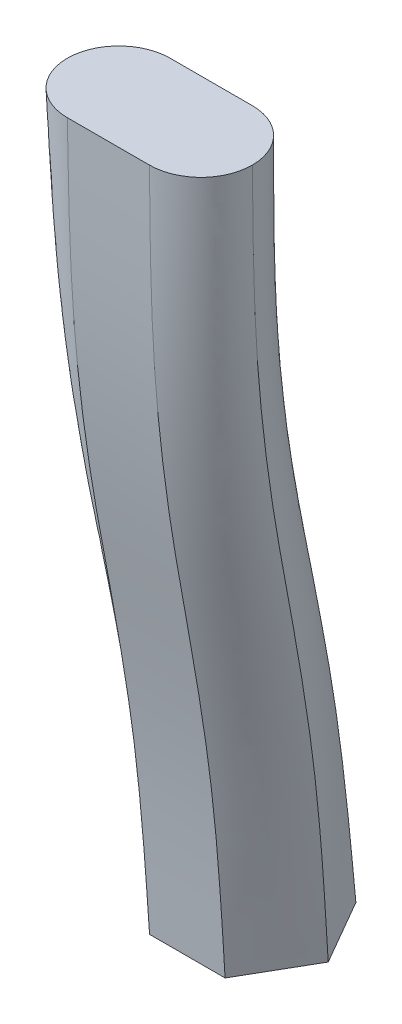
ISO-10303-21;
HEADER;
FILE_DESCRIPTION(('STEP AP214'),'2;1');
FILE_NAME('part.step','',(''),(''),'','','');
FILE_SCHEMA(('AUTOMOTIVE_DESIGN { 1 0 10303 214 1 1 1 1 }'));
ENDSEC;
DATA;
#1=APPLICATION_CONTEXT('core data for automotive mechanical design processes');
#2=APPLICATION_PROTOCOL_DEFINITION('international standard','automotive_design',2000,#1);
#3=PRODUCT_CONTEXT('',#1,'mechanical');
#4=PRODUCT('Part','Part','',(#3));
#5=PRODUCT_RELATED_PRODUCT_CATEGORY('part','',(#4));
#6=PRODUCT_DEFINITION_FORMATION('','',#4);
#7=PRODUCT_DEFINITION_CONTEXT('part definition',#1,'design');
#8=PRODUCT_DEFINITION('design','',#6,#7);
#9=PRODUCT_DEFINITION_SHAPE('','',#8);
#10=(LENGTH_UNIT() NAMED_UNIT(*) SI_UNIT(.MILLI.,.METRE.));
#11=(NAMED_UNIT(*) PLANE_ANGLE_UNIT() SI_UNIT($,.RADIAN.));
#12=(NAMED_UNIT(*) SI_UNIT($,.STERADIAN.) SOLID_ANGLE_UNIT());
#13=UNCERTAINTY_MEASURE_WITH_UNIT(LENGTH_MEASURE(1.E-05),#10,'distance_accuracy_value','');
#14=(GEOMETRIC_REPRESENTATION_CONTEXT(3) GLOBAL_UNCERTAINTY_ASSIGNED_CONTEXT((#13)) GLOBAL_UNIT_ASSIGNED_CONTEXT((#10,
#11,#12)) REPRESENTATION_CONTEXT('',''));
#15=CARTESIAN_POINT('',(0.,0.,0.));
#16=DIRECTION('',(0.,0.,1.));
#17=DIRECTION('',(1.,0.,0.));
#18=AXIS2_PLACEMENT_3D('',#15,#16,#17);
#19=CARTESIAN_POINT('',(0.,-698.8189008,0.));
#20=DIRECTION('',(0.,1.,0.));
#21=DIRECTION('',(0.,0.,1.));
#22=AXIS2_PLACEMENT_3D('',#19,#20,#21);
#23=PLANE('',#22);
#24=DIRECTION('',(1.,0.,0.));
#25=VECTOR('',#24,1.);
#26=CARTESIAN_POINT('',(-35.4084634377862,-698.8189008,84.0918648163071));
#27=LINE('',#26,#25);
#28=CARTESIAN_POINT('',(-35.4084634377862,-698.8189008,84.0918648163071));
#29=VERTEX_POINT('',#28);
#30=CARTESIAN_POINT('',(35.4084634377862,-698.8189008,84.0918648163071));
#31=VERTEX_POINT('',#30);
#32=EDGE_CURVE('E572',#29,#31,#27,.T.);
#33=ORIENTED_EDGE('',*,*,#32,.F.);
#34=DIRECTION('',(0.5,0.,0.866025403784439));
#35=VECTOR('',#34,1.);
#36=CARTESIAN_POINT('',(-70.8169268755724,-698.8189008,22.7626071241164));
#37=LINE('',#36,#35);
#38=CARTESIAN_POINT('',(-70.8169268755724,-698.8189008,22.7626071241164));
#39=VERTEX_POINT('',#38);
#40=EDGE_CURVE('E562',#39,#29,#37,.T.);
#41=ORIENTED_EDGE('',*,*,#40,.F.);
#42=DIRECTION('',(-0.5,0.,0.866025403784439));
#43=VECTOR('',#42,1.);
#44=CARTESIAN_POINT('',(-35.4084634377863,-698.8189008,-38.5666505680744));
#45=LINE('',#44,#43);
#46=CARTESIAN_POINT('',(-35.4084634377863,-698.8189008,-38.5666505680744));
#47=VERTEX_POINT('',#46);
#48=EDGE_CURVE('E588',#47,#39,#45,.T.);
#49=ORIENTED_EDGE('',*,*,#48,.F.);
#50=DIRECTION('',(-1.,0.,0.));
#51=VECTOR('',#50,1.);
#52=CARTESIAN_POINT('',(35.4084634377862,-698.8189008,-38.5666505680744));
#53=LINE('',#52,#51);
#54=CARTESIAN_POINT('',(35.4084634377862,-698.8189008,-38.5666505680744));
#55=VERTEX_POINT('',#54);
#56=EDGE_CURVE('E610',#55,#47,#53,.T.);
#57=ORIENTED_EDGE('',*,*,#56,.F.);
#58=DIRECTION('',(-0.5,0.,-0.866025403784438));
#59=VECTOR('',#58,1.);
#60=CARTESIAN_POINT('',(70.8169268755724,-698.8189008,22.7626071241163));
#61=LINE('',#60,#59);
#62=CARTESIAN_POINT('',(70.8169268755724,-698.8189008,22.7626071241163));
#63=VERTEX_POINT('',#62);
#64=EDGE_CURVE('E599',#63,#55,#61,.T.);
#65=ORIENTED_EDGE('',*,*,#64,.F.);
#66=DIRECTION('',(0.5,0.,-0.866025403784439));
#67=VECTOR('',#66,1.);
#68=CARTESIAN_POINT('',(35.4084634377862,-698.8189008,84.0918648163071));
#69=LINE('',#68,#67);
#70=EDGE_CURVE('E593',#31,#63,#69,.T.);
#71=ORIENTED_EDGE('',*,*,#70,.F.);
#72=EDGE_LOOP('',(#33,#41,#49,#57,#65,#71));
#73=FACE_BOUND('',#72,.T.);
#74=ADVANCED_FACE('F515',(#73),#23,.F.);
#75=CARTESIAN_POINT('',(-38.5065648534128,0.,109.89447289182));
#76=DIRECTION('',(0.,1.,0.));
#77=DIRECTION('',(0.,0.,1.));
#78=AXIS2_PLACEMENT_3D('',#75,#76,#77);
#79=PLANE('',#78);
#80=CARTESIAN_POINT('',(-38.5065648534128,0.,109.89447289182));
#81=DIRECTION('',(0.,1.,0.));
#82=DIRECTION('',(0.,0.,1.));
#83=AXIS2_PLACEMENT_3D('',#80,#81,#82);
#84=CIRCLE('',#83,48.2563794323738);
#85=CARTESIAN_POINT('',(-38.5065648534128,0.,61.6380934594463));
#86=VERTEX_POINT('',#85);
#87=CARTESIAN_POINT('',(-86.7629442857865,0.,109.89447289182));
#88=VERTEX_POINT('',#87);
#89=EDGE_CURVE('E534',#86,#88,#84,.T.);
#90=ORIENTED_EDGE('',*,*,#89,.T.);
#91=CARTESIAN_POINT('',(-38.5065648534128,0.,158.150852324194));
#92=VERTEX_POINT('',#91);
#93=EDGE_CURVE('E579',#88,#92,#84,.T.);
#94=ORIENTED_EDGE('',*,*,#93,.T.);
#95=DIRECTION('',(1.,0.,0.));
#96=VECTOR('',#95,1.);
#97=CARTESIAN_POINT('',(-38.5065648534128,0.,158.150852324194));
#98=LINE('',#97,#96);
#99=CARTESIAN_POINT('',(38.5065648534128,0.,158.150852324194));
#100=VERTEX_POINT('',#99);
#101=EDGE_CURVE('E576',#92,#100,#98,.T.);
#102=ORIENTED_EDGE('',*,*,#101,.T.);
#103=CARTESIAN_POINT('',(38.5065648534128,0.,109.89447289182));
#104=DIRECTION('',(0.,1.,0.));
#105=DIRECTION('',(0.,0.,1.));
#106=AXIS2_PLACEMENT_3D('',#103,#104,#105);
#107=CIRCLE('',#106,48.2563794323738);
#108=CARTESIAN_POINT('',(86.7629442857865,0.,109.89447289182));
#109=VERTEX_POINT('',#108);
#110=EDGE_CURVE('E526',#100,#109,#107,.T.);
#111=ORIENTED_EDGE('',*,*,#110,.T.);
#112=CARTESIAN_POINT('',(38.5065648534128,0.,61.6380934594463));
#113=VERTEX_POINT('',#112);
#114=EDGE_CURVE('E694',#109,#113,#107,.T.);
#115=ORIENTED_EDGE('',*,*,#114,.T.);
#116=DIRECTION('',(-1.,0.,0.));
#117=VECTOR('',#116,1.);
#118=CARTESIAN_POINT('',(-38.5065648534128,0.,61.6380934594463));
#119=LINE('',#118,#117);
#120=EDGE_CURVE('E12',#113,#86,#119,.T.);
#121=ORIENTED_EDGE('',*,*,#120,.T.);
#122=EDGE_LOOP('',(#90,#94,#102,#111,#115,#121));
#123=FACE_BOUND('',#122,.T.);
#124=ADVANCED_FACE('F640',(#123),#79,.T.);
#125=CARTESIAN_POINT('',(38.5065648534128,0.,158.150852324194));
#126=CARTESIAN_POINT('',(38.2793711629196,-52.4456672411362,157.489173458208));
#127=CARTESIAN_POINT('',(37.9902165226029,-119.19447533684,156.647039532376));
#128=CARTESIAN_POINT('',(37.5358323503757,-225.156882436225,148.10458382802));
#129=CARTESIAN_POINT('',(37.184658630993,-307.358410072955,137.105037974719));
#130=CARTESIAN_POINT('',(36.7303399892891,-409.771135398062,117.536665152822));
#131=CARTESIAN_POINT('',(36.3792227327347,-485.83394403774,104.324679325509));
#132=CARTESIAN_POINT('',(35.9248020332829,-584.71735182618,91.509283947088));
#133=CARTESIAN_POINT('',(35.6356533775866,-648.614007598946,87.3555429927861));
#134=CARTESIAN_POINT('',(35.4084634377862,-698.8189008,84.0918648163071));
#135=CARTESIAN_POINT('',(-38.5065648534128,0.,158.150852324194));
#136=CARTESIAN_POINT('',(-38.2793711629196,-52.4456672411362,157.489173458208));
#137=CARTESIAN_POINT('',(-37.9902165226029,-119.19447533684,156.647039532376));
#138=CARTESIAN_POINT('',(-37.5358323503757,-225.156882436225,148.10458382802));
#139=CARTESIAN_POINT('',(-37.184658630993,-307.358410072955,137.105037974719));
#140=CARTESIAN_POINT('',(-36.730339989289,-409.771135398062,117.536665152822));
#141=CARTESIAN_POINT('',(-36.3792227327347,-485.83394403774,104.324679325509));
#142=CARTESIAN_POINT('',(-35.9248020332828,-584.71735182618,91.509283947088));
#143=CARTESIAN_POINT('',(-35.6356533775866,-648.614007598946,87.3555429927861));
#144=CARTESIAN_POINT('',(-35.4084634377862,-698.8189008,84.0918648163071));
#145=B_SPLINE_SURFACE_WITH_KNOTS('',1,3,((#125,#126,#127,#128,#129,#130,#131,#132,#133,#134),
(#135,#136,#137,#138,#139,#140,#141,#142,#143,#144)),.UNSPECIFIED.,.F.,.F.,.F.,(2,2),(4,1,1,1,1,
1,1,4),(0.,1.),(0.,0.219994570451526,0.279992154502479,0.439982977628321,0.559997259575471,
0.720005923175187,0.780002997748297,1.),.UNSPECIFIED.);
#146=CARTESIAN_POINT('',(-38.5065648534128,0.,158.150852324194));
#147=CARTESIAN_POINT('',(-38.2793711629196,-52.4456672411362,157.489173458208));
#148=CARTESIAN_POINT('',(-37.9902165226029,-119.19447533684,156.647039532376));
#149=CARTESIAN_POINT('',(-37.5358323503757,-225.156882436225,148.10458382802));
#150=CARTESIAN_POINT('',(-37.184658630993,-307.358410072955,137.105037974719));
#151=CARTESIAN_POINT('',(-36.730339989289,-409.771135398062,117.536665152822));
#152=CARTESIAN_POINT('',(-36.3792227327347,-485.83394403774,104.324679325509));
#153=CARTESIAN_POINT('',(-35.9248020332828,-584.71735182618,91.509283947088));
#154=CARTESIAN_POINT('',(-35.6356533775866,-648.614007598946,87.3555429927861));
#155=CARTESIAN_POINT('',(-35.4084634377862,-698.8189008,84.0918648163071));
#156=B_SPLINE_CURVE_WITH_KNOTS('',3,(#146,#147,#148,#149,#150,#151,#152,#153,#154,#155),
.UNSPECIFIED.,.F.,.F.,(4,1,1,1,1,1,1,4),(0.,0.219994570451526,0.279992154502479,
0.439982977628321,0.559997259575471,0.720005923175187,0.780002997748297,1.),.UNSPECIFIED.);
#157=EDGE_CURVE('E569',#92,#29,#156,.T.);
#158=CARTESIAN_POINT('',(38.5065648534128,0.,158.150852324194));
#159=CARTESIAN_POINT('',(38.2793711629196,-52.4456672411362,157.489173458208));
#160=CARTESIAN_POINT('',(37.9902165226029,-119.19447533684,156.647039532376));
#161=CARTESIAN_POINT('',(37.5358323503757,-225.156882436225,148.10458382802));
#162=CARTESIAN_POINT('',(37.184658630993,-307.358410072955,137.105037974719));
#163=CARTESIAN_POINT('',(36.7303399892891,-409.771135398062,117.536665152822));
#164=CARTESIAN_POINT('',(36.3792227327347,-485.83394403774,104.324679325509));
#165=CARTESIAN_POINT('',(35.9248020332829,-584.71735182618,91.509283947088));
#166=CARTESIAN_POINT('',(35.6356533775866,-648.614007598946,87.3555429927861));
#167=CARTESIAN_POINT('',(35.4084634377862,-698.8189008,84.0918648163071));
#168=B_SPLINE_CURVE_WITH_KNOTS('',3,(#158,#159,#160,#161,#162,#163,#164,#165,#166,#167),
.UNSPECIFIED.,.F.,.F.,(4,1,1,1,1,1,1,4),(0.,0.219994570451526,0.279992154502479,
0.439982977628321,0.559997259575471,0.720005923175187,0.780002997748297,1.),.UNSPECIFIED.);
#169=EDGE_CURVE('E580',#31,#100,#168,.F.);
#170=ORIENTED_EDGE('',*,*,#101,.F.);
#171=ORIENTED_EDGE('',*,*,#157,.T.);
#172=ORIENTED_EDGE('',*,*,#32,.T.);
#173=ORIENTED_EDGE('',*,*,#169,.T.);
#174=EDGE_LOOP('',(#170,#171,#172,#173));
#175=FACE_BOUND('',#174,.T.);
#176=ADVANCED_FACE('F570',(#175),#145,.T.);
#177=CARTESIAN_POINT('',(-38.5065648534128,0.,158.150852324194));
#178=CARTESIAN_POINT('',(-38.2793711629197,-52.4456672411362,157.489173458208));
#179=CARTESIAN_POINT('',(-37.990216522603,-119.19447533684,156.647039532376));
#180=CARTESIAN_POINT('',(-37.5358323503757,-225.156882436225,148.10458382802));
#181=CARTESIAN_POINT('',(-37.184658630993,-307.358410072955,137.105037974719));
#182=CARTESIAN_POINT('',(-36.730339989289,-409.771135398063,117.536665152822));
#183=CARTESIAN_POINT('',(-36.3792227327347,-485.83394403774,104.324679325509));
#184=CARTESIAN_POINT('',(-35.9248020332828,-584.71735182618,91.509283947088));
#185=CARTESIAN_POINT('',(-35.6356533775866,-648.614007598946,87.3555429927861));
#186=CARTESIAN_POINT('',(-35.4084634377862,-698.8189008,84.0918648163071));
#187=CARTESIAN_POINT('',(-41.8357423700717,0.,158.150852324194));
#188=CARTESIAN_POINT('',(-41.3076886273964,-52.4497218571126,157.333963765018));
#189=CARTESIAN_POINT('',(-40.6356224723031,-119.203690355915,156.294290889444));
#190=CARTESIAN_POINT('',(-40.0501707237789,-225.121354838114,147.413789934405));
#191=CARTESIAN_POINT('',(-39.542364179335,-307.248853078732,136.145876774943));
#192=CARTESIAN_POINT('',(-38.8914414611402,-409.577505927055,116.211002239127));
#193=CARTESIAN_POINT('',(-38.3712347883246,-485.662969323431,102.687612446893));
#194=CARTESIAN_POINT('',(-37.6873599634519,-584.617362017862,89.4546669787473));
#195=CARTESIAN_POINT('',(-37.2373768798272,-648.57001189781,85.020496442799));
#196=CARTESIAN_POINT('',(-36.8838160810273,-698.8189008,81.5364790791324));
#197=CARTESIAN_POINT('',(-48.3375205023217,0.,157.475134846097));
#198=CARTESIAN_POINT('',(-47.3534142799289,-52.448964088748,156.431055051176));
#199=CARTESIAN_POINT('',(-46.1009196347133,-119.201968158307,155.1022306595));
#200=CARTESIAN_POINT('',(-45.1717702365236,-225.004089780043,145.577026226769));
#201=CARTESIAN_POINT('',(-44.330156436265,-306.963102756361,133.823463896808));
#202=CARTESIAN_POINT('',(-43.2465990978619,-409.129937221206,113.226890988725));
#203=CARTESIAN_POINT('',(-42.3712138425049,-485.286613062949,99.1547142298995));
#204=CARTESIAN_POINT('',(-41.2097362291017,-584.406538037505,85.1801679964597));
#205=CARTESIAN_POINT('',(-40.4396184575637,-648.477248955385,80.2776864161999));
#206=CARTESIAN_POINT('',(-39.8345213675095,-698.8189008,76.4257076047832));
#207=CARTESIAN_POINT('',(-57.4257792811073,0.,154.629083911046));
#208=CARTESIAN_POINT('',(-56.1081647212131,-52.418165584179,153.353894173958));
#209=CARTESIAN_POINT('',(-54.4312063368701,-119.131971687934,151.730930838301));
#210=CARTESIAN_POINT('',(-52.8367827893716,-224.683810263619,141.43829462464));
#211=CARTESIAN_POINT('',(-51.470606805704,-306.334373409746,129.142523649802));
#212=CARTESIAN_POINT('',(-49.7055030909262,-408.286045257144,107.810429563564));
#213=CARTESIAN_POINT('',(-48.2961530462552,-484.624843519122,93.1318992029192));
#214=CARTESIAN_POINT('',(-46.4351846426689,-584.063468461784,78.3544238223734));
#215=CARTESIAN_POINT('',(-45.217409683007,-648.326297705691,72.981312500072));
#216=CARTESIAN_POINT('',(-44.2605792972328,-698.8189008,68.7595503932593));
#217=CARTESIAN_POINT('',(-65.6549519239182,0.,150.145235974477));
#218=CARTESIAN_POINT('',(-64.2441639613719,-52.3544782837156,148.608135652902));
#219=CARTESIAN_POINT('',(-62.4486216424466,-118.987228093969,146.651832686693));
#220=CARTESIAN_POINT('',(-60.1648810490101,-224.213712735654,135.903155380466));
#221=CARTESIAN_POINT('',(-58.317619042398,-305.505261696571,123.277828026121));
#222=CARTESIAN_POINT('',(-55.9158283088128,-407.278032510116,101.512194564613));
#223=CARTESIAN_POINT('',(-54.0233625615989,-483.871821541012,86.4383987094744));
#224=CARTESIAN_POINT('',(-51.552488862967,-583.699266539556,71.1965127363408));
#225=CARTESIAN_POINT('',(-49.94761726281,-648.166048184335,65.538784526535));
#226=CARTESIAN_POINT('',(-48.6866372269561,-698.8189008,61.0933931817355));
#227=CARTESIAN_POINT('',(-72.8303607143679,0.,144.218268752776));
#228=CARTESIAN_POINT('',(-71.4471636842793,-52.2609333510636,142.393933169613));
#229=CARTESIAN_POINT('',(-69.6867369802881,-118.774626371951,140.072059273285));
#230=CARTESIAN_POINT('',(-66.8261963210032,-223.611442968533,129.164408825724));
#231=CARTESIAN_POINT('',(-64.6063122637007,-304.50454678363,116.41842730641));
#232=CARTESIAN_POINT('',(-61.7020266011313,-406.130635144782,94.4778916364693));
#233=CARTESIAN_POINT('',(-59.4382417416191,-483.042185934245,79.1983510841377));
#234=CARTESIAN_POINT('',(-56.4960747752135,-583.314941614187,63.7531121198341));
#235=CARTESIAN_POINT('',(-54.6013884648316,-647.99694450427,57.9706406300209));
#236=CARTESIAN_POINT('',(-53.1126951566793,-698.818900800001,53.4272359702117));
#237=CARTESIAN_POINT('',(-78.7573279360701,0.,137.042859962326));
#238=CARTESIAN_POINT('',(-77.4017505395368,-52.1413322486332,134.930974094302));
#239=CARTESIAN_POINT('',(-75.6764759790275,-118.502806193015,132.243128330484));
#240=CARTESIAN_POINT('',(-72.4985427381504,-222.898041411342,121.442946098835));
#241=CARTESIAN_POINT('',(-70.0697736970872,-303.360110042019,108.745942549677));
#242=CARTESIAN_POINT('',(-66.8892236008882,-404.868887038706,86.8556899854787));
#243=CARTESIAN_POINT('',(-64.4261262036988,-482.150547342664,71.5356616239297));
#244=CARTESIAN_POINT('',(-61.2004113282873,-582.911522056835,56.0710568084713));
#245=CARTESIAN_POINT('',(-59.1498895050218,-647.819439150712,50.2974882250778));
#246=CARTESIAN_POINT('',(-57.5387530864026,-698.8189008,45.7610787586879));
#247=CARTESIAN_POINT('',(-83.2411758726391,0.,128.813687319515));
#248=CARTESIAN_POINT('',(-81.8963721501373,-52.0046085392962,126.545149458241));
#249=CARTESIAN_POINT('',(-80.1848094925981,-118.192071071168,123.65792909619));
#250=CARTESIAN_POINT('',(-76.9923610479053,-222.110479546602,113.08928797434));
#251=CARTESIAN_POINT('',(-74.557991483538,-302.120121474075,100.557707757633));
#252=CARTESIAN_POINT('',(-71.360048838805,-403.528683931652,78.8500342073114));
#253=CARTESIAN_POINT('',(-68.890668155481,-481.21432111911,63.5923704018113));
#254=CARTESIAN_POINT('',(-65.6355135672792,-582.493679105146,48.2325295211226));
#255=CARTESIAN_POINT('',(-63.5799269476,-647.635587476891,42.5554878604533));
#256=CARTESIAN_POINT('',(-61.9648110161259,-698.8189008,38.094921547164));
#257=CARTESIAN_POINT('',(-86.0872268076895,0.,119.725428540729));
#258=CARTESIAN_POINT('',(-84.7412409446718,-51.8595459648039,117.559521323171));
#259=CARTESIAN_POINT('',(-83.0281737496829,-117.862384018506,114.802921344128));
#260=CARTESIAN_POINT('',(-80.1424702139385,-221.286534600468,104.461170735621));
#261=CARTESIAN_POINT('',(-77.9145064173394,-300.8325379858,92.1491486345682));
#262=CARTESIAN_POINT('',(-74.9992698134144,-402.145992227038,70.6660016972441));
#263=CARTESIAN_POINT('',(-72.735317566209,-480.250915932085,55.5104576318534));
#264=CARTESIAN_POINT('',(-69.7715331816715,-582.066088513111,40.3197534209143));
#265=CARTESIAN_POINT('',(-67.8783674805713,-647.447446823237,34.7808178804427));
#266=CARTESIAN_POINT('',(-66.3908689458492,-698.8189008,30.4287643356402));
#267=CARTESIAN_POINT('',(-86.7629442857865,0.,113.223650408479));
#268=CARTESIAN_POINT('',(-85.5040253636395,-51.7630399659438,111.374795981787));
#269=CARTESIAN_POINT('',(-83.9017702687413,-117.643052613147,109.02171638883));
#270=CARTESIAN_POINT('',(-81.3673970019989,-220.737458027694,98.7495782276898));
#271=CARTESIAN_POINT('',(-79.4019331332344,-299.972377321211,86.5753732163795));
#272=CARTESIAN_POINT('',(-76.847189294089,-401.219319293611,65.2210102669118));
#273=CARTESIAN_POINT('',(-74.863503782041,-479.602701608787,50.1248968184136));
#274=CARTESIAN_POINT('',(-72.2874470174756,-581.776491082401,35.0410823277257));
#275=CARTESIAN_POINT('',(-70.6377637222391,-647.320023416536,29.596170262359));
#276=CARTESIAN_POINT('',(-69.3415742323314,-698.8189008,25.317992861291));
#277=CARTESIAN_POINT('',(-86.7629442857865,0.,109.89447289182));
#278=CARTESIAN_POINT('',(-85.5935718030716,-51.7161140165555,108.281416661109));
#279=CARTESIAN_POINT('',(-84.1052845231662,-117.536402927648,106.228442860695));
#280=CARTESIAN_POINT('',(-81.7665560733112,-220.468548819817,95.9553790652406));
#281=CARTESIAN_POINT('',(-79.9590548033268,-299.549487722888,83.8423323058423));
#282=CARTESIAN_POINT('',(-77.6206636409665,-400.760577249292,62.5333742206344));
#283=CARTESIAN_POINT('',(-75.8134529867892,-479.280156694641,47.4564469294874));
#284=CARTESIAN_POINT('',(-73.474536530255,-581.63104540207,32.4123534693795));
#285=CARTESIAN_POINT('',(-71.9862800533636,-647.256027047396,27.0085134158211));
#286=CARTESIAN_POINT('',(-70.8169268755724,-698.8189008,22.7626071241164));
#287=B_SPLINE_SURFACE_WITH_KNOTS('',3,3,((#177,#178,#179,#180,#181,#182,#183,#184,#185,#186),
(#187,#188,#189,#190,#191,#192,#193,#194,#195,#196),(#197,#198,#199,#200,#201,#202,#203,#204,
#205,#206),(#207,#208,#209,#210,#211,#212,#213,#214,#215,#216),(#217,#218,#219,#220,#221,#222,
#223,#224,#225,#226),(#227,#228,#229,#230,#231,#232,#233,#234,#235,#236),(#237,#238,#239,#240,
#241,#242,#243,#244,#245,#246),(#247,#248,#249,#250,#251,#252,#253,#254,#255,#256),(#257,#258,
#259,#260,#261,#262,#263,#264,#265,#266),(#267,#268,#269,#270,#271,#272,#273,#274,#275,#276),
(#277,#278,#279,#280,#281,#282,#283,#284,#285,#286)),.UNSPECIFIED.,.F.,.F.,.F.,(4,1,1,1,1,1,1,1,
4),(4,1,1,1,1,1,1,4),(0.,0.125,0.25,0.375,0.5,0.625,0.75,0.875,1.),(0.,0.219994570451526,
0.279992154502479,0.439982977628321,0.559997259575471,0.720005923175187,0.780002997748297,1.),.UNSPECIFIED.);
#288=CARTESIAN_POINT('',(-86.7629442857865,0.,109.89447289182));
#289=CARTESIAN_POINT('',(-85.5935718030716,-51.7161140165555,108.281416661109));
#290=CARTESIAN_POINT('',(-84.1052845231662,-117.536402927648,106.228442860695));
#291=CARTESIAN_POINT('',(-81.7665560733112,-220.468548819817,95.9553790652406));
#292=CARTESIAN_POINT('',(-79.9590548033268,-299.549487722888,83.8423323058423));
#293=CARTESIAN_POINT('',(-77.6206636409665,-400.760577249292,62.5333742206344));
#294=CARTESIAN_POINT('',(-75.8134529867892,-479.280156694641,47.4564469294874));
#295=CARTESIAN_POINT('',(-73.474536530255,-581.63104540207,32.4123534693795));
#296=CARTESIAN_POINT('',(-71.9862800533636,-647.256027047396,27.0085134158211));
#297=CARTESIAN_POINT('',(-70.8169268755724,-698.8189008,22.7626071241164));
#298=B_SPLINE_CURVE_WITH_KNOTS('',3,(#288,#289,#290,#291,#292,#293,#294,#295,#296,#297),
.UNSPECIFIED.,.F.,.F.,(4,1,1,1,1,1,1,4),(0.,0.219994570451526,0.279992154502479,
0.439982977628321,0.559997259575471,0.720005923175187,0.780002997748297,1.),.UNSPECIFIED.);
#299=EDGE_CURVE('E586',#88,#39,#298,.T.);
#300=ORIENTED_EDGE('',*,*,#93,.F.);
#301=ORIENTED_EDGE('',*,*,#299,.T.);
#302=ORIENTED_EDGE('',*,*,#40,.T.);
#303=ORIENTED_EDGE('',*,*,#157,.F.);
#304=EDGE_LOOP('',(#300,#301,#302,#303));
#305=FACE_BOUND('',#304,.T.);
#306=ADVANCED_FACE('F584',(#305),#287,.T.);
#307=CARTESIAN_POINT('',(86.7629442857865,0.,109.89447289182));
#308=CARTESIAN_POINT('',(85.5935718030716,-51.7161140165555,108.281416661109));
#309=CARTESIAN_POINT('',(84.1052845231662,-117.536402927648,106.228442860695));
#310=CARTESIAN_POINT('',(81.7665560733112,-220.468548819817,95.9553790652406));
#311=CARTESIAN_POINT('',(79.9590548033268,-299.549487722888,83.8423323058423));
#312=CARTESIAN_POINT('',(77.6206636409665,-400.760577249292,62.5333742206344));
#313=CARTESIAN_POINT('',(75.8134529867892,-479.280156694641,47.4564469294874));
#314=CARTESIAN_POINT('',(73.474536530255,-581.63104540207,32.4123534693795));
#315=CARTESIAN_POINT('',(71.9862800533636,-647.256027047396,27.0085134158211));
#316=CARTESIAN_POINT('',(70.8169268755724,-698.8189008,22.7626071241163));
#317=CARTESIAN_POINT('',(86.7629442857865,0.,113.223650408479));
#318=CARTESIAN_POINT('',(85.5040253636395,-51.7630399659438,111.374795981787));
#319=CARTESIAN_POINT('',(83.9017702687413,-117.643052613147,109.02171638883));
#320=CARTESIAN_POINT('',(81.367397001999,-220.737458027694,98.7495782276899));
#321=CARTESIAN_POINT('',(79.4019331332343,-299.97237732121,86.5753732163795));
#322=CARTESIAN_POINT('',(76.847189294089,-401.219319293611,65.2210102669117));
#323=CARTESIAN_POINT('',(74.863503782041,-479.602701608787,50.1248968184136));
#324=CARTESIAN_POINT('',(72.2874470174756,-581.776491082401,35.0410823277257));
#325=CARTESIAN_POINT('',(70.6377637222391,-647.320023416536,29.5961702623589));
#326=CARTESIAN_POINT('',(69.3415742323314,-698.8189008,25.3179928612909));
#327=CARTESIAN_POINT('',(86.0872268076894,0.,119.725428540729));
#328=CARTESIAN_POINT('',(84.7412409446717,-51.8595459648034,117.559521323171));
#329=CARTESIAN_POINT('',(83.0281737496828,-117.862384018504,114.802921344128));
#330=CARTESIAN_POINT('',(80.1424702139385,-221.286534600469,104.461170735621));
#331=CARTESIAN_POINT('',(77.9145064173392,-300.8325379858,92.1491486345682));
#332=CARTESIAN_POINT('',(74.9992698134144,-402.145992227037,70.6660016972439));
#333=CARTESIAN_POINT('',(72.7353175662089,-480.250915932086,55.5104576318535));
#334=CARTESIAN_POINT('',(69.7715331816714,-582.06608851311,40.319753420914));
#335=CARTESIAN_POINT('',(67.8783674805713,-647.447446823237,34.7808178804426));
#336=CARTESIAN_POINT('',(66.3908689458492,-698.8189008,30.4287643356402));
#337=CARTESIAN_POINT('',(83.2411758726388,0.,128.813687319514));
#338=CARTESIAN_POINT('',(81.8963721501372,-52.0046085392971,126.545149458241));
#339=CARTESIAN_POINT('',(80.1848094925982,-118.19207107117,123.657929096191));
#340=CARTESIAN_POINT('',(76.9923610479052,-222.110479546602,113.08928797434));
#341=CARTESIAN_POINT('',(74.5579914835378,-302.120121474075,100.557707757633));
#342=CARTESIAN_POINT('',(71.360048838805,-403.528683931651,78.8500342073111));
#343=CARTESIAN_POINT('',(68.890668155481,-481.214321119112,63.5923704018117));
#344=CARTESIAN_POINT('',(65.6355135672791,-582.493679105144,48.232529521122));
#345=CARTESIAN_POINT('',(63.5799269476,-647.63558747689,42.555487860453));
#346=CARTESIAN_POINT('',(61.964811016126,-698.8189008,38.094921547164));
#347=CARTESIAN_POINT('',(78.75732793607,0.,137.042859962326));
#348=CARTESIAN_POINT('',(77.4017505395366,-52.1413322486315,134.930974094302));
#349=CARTESIAN_POINT('',(75.6764759790271,-118.502806193011,132.243128330483));
#350=CARTESIAN_POINT('',(72.4985427381507,-222.898041411343,121.442946098835));
#351=CARTESIAN_POINT('',(70.0697736970872,-303.360110042019,108.745942549677));
#352=CARTESIAN_POINT('',(66.8892236008882,-404.868887038706,86.8556899854788));
#353=CARTESIAN_POINT('',(64.4261262036989,-482.150547342663,71.5356616239296));
#354=CARTESIAN_POINT('',(61.2004113282872,-582.911522056835,56.0710568084713));
#355=CARTESIAN_POINT('',(59.1498895050218,-647.819439150712,50.2974882250778));
#356=CARTESIAN_POINT('',(57.5387530864026,-698.8189008,45.7610787586878));
#357=CARTESIAN_POINT('',(72.8303607143681,0.,144.218268752776));
#358=CARTESIAN_POINT('',(71.4471636842792,-52.2609333510654,142.393933169613));
#359=CARTESIAN_POINT('',(69.6867369802877,-118.774626371955,140.072059273285));
#360=CARTESIAN_POINT('',(66.8261963210032,-223.611442968531,129.164408825725));
#361=CARTESIAN_POINT('',(64.606312263701,-304.504546783631,116.41842730641));
#362=CARTESIAN_POINT('',(61.7020266011313,-406.130635144782,94.4778916364698));
#363=CARTESIAN_POINT('',(59.4382417416192,-483.042185934243,79.1983510841371));
#364=CARTESIAN_POINT('',(56.4960747752136,-583.314941614189,63.7531121198348));
#365=CARTESIAN_POINT('',(54.6013884648316,-647.99694450427,57.9706406300212));
#366=CARTESIAN_POINT('',(53.1126951566793,-698.818900800001,53.4272359702117));
#367=CARTESIAN_POINT('',(65.6549519239184,0.,150.145235974478));
#368=CARTESIAN_POINT('',(64.244163961372,-52.3544782837141,148.608135652902));
#369=CARTESIAN_POINT('',(62.4486216424466,-118.987228093966,146.651832686693));
#370=CARTESIAN_POINT('',(60.1648810490103,-224.213712735656,135.903155380466));
#371=CARTESIAN_POINT('',(58.3176190423981,-305.505261696571,123.277828026122));
#372=CARTESIAN_POINT('',(55.9158283088128,-407.278032510116,101.512194564613));
#373=CARTESIAN_POINT('',(54.0233625615989,-483.871821541011,86.4383987094741));
#374=CARTESIAN_POINT('',(51.5524888629671,-583.699266539556,71.1965127363411));
#375=CARTESIAN_POINT('',(49.94761726281,-648.166048184335,65.5387845265352));
#376=CARTESIAN_POINT('',(48.686637226956,-698.8189008,61.0933931817355));
#377=CARTESIAN_POINT('',(57.4257792811074,0.,154.629083911046));
#378=CARTESIAN_POINT('',(56.1081647212131,-52.4181655841802,153.353894173959));
#379=CARTESIAN_POINT('',(54.43120633687,-119.131971687937,151.730930838302));
#380=CARTESIAN_POINT('',(52.8367827893715,-224.683810263617,141.438294624639));
#381=CARTESIAN_POINT('',(51.4706068057038,-306.334373409747,129.142523649802));
#382=CARTESIAN_POINT('',(49.7055030909263,-408.286045257144,107.810429563563));
#383=CARTESIAN_POINT('',(48.2961530462552,-484.624843519122,93.1318992029194));
#384=CARTESIAN_POINT('',(46.4351846426688,-584.063468461783,78.3544238223731));
#385=CARTESIAN_POINT('',(45.217409683007,-648.326297705691,72.9813125000719));
#386=CARTESIAN_POINT('',(44.2605792972328,-698.8189008,68.7595503932594));
#387=CARTESIAN_POINT('',(48.3375205023217,0.,157.475134846097));
#388=CARTESIAN_POINT('',(47.3534142799288,-52.4489640887471,156.431055051176));
#389=CARTESIAN_POINT('',(46.1009196347131,-119.201968158305,155.102230659499));
#390=CARTESIAN_POINT('',(45.1717702365238,-225.004089780044,145.577026226769));
#391=CARTESIAN_POINT('',(44.3301564362649,-306.963102756361,133.823463896808));
#392=CARTESIAN_POINT('',(43.2465990978619,-409.129937221206,113.226890988725));
#393=CARTESIAN_POINT('',(42.3712138425049,-485.286613062949,99.1547142298995));
#394=CARTESIAN_POINT('',(41.2097362291016,-584.406538037505,85.1801679964596));
#395=CARTESIAN_POINT('',(40.4396184575637,-648.477248955385,80.2776864161998));
#396=CARTESIAN_POINT('',(39.8345213675095,-698.8189008,76.4257076047832));
#397=CARTESIAN_POINT('',(41.8357423700717,0.,158.150852324194));
#398=CARTESIAN_POINT('',(41.3076886273964,-52.4497218571127,157.333963765018));
#399=CARTESIAN_POINT('',(40.6356224723031,-119.203690355915,156.294290889444));
#400=CARTESIAN_POINT('',(40.0501707237789,-225.121354838113,147.413789934405));
#401=CARTESIAN_POINT('',(39.542364179335,-307.248853078732,136.145876774943));
#402=CARTESIAN_POINT('',(38.8914414611402,-409.577505927055,116.211002239127));
#403=CARTESIAN_POINT('',(38.3712347883246,-485.662969323431,102.687612446893));
#404=CARTESIAN_POINT('',(37.6873599634519,-584.617362017862,89.4546669787473));
#405=CARTESIAN_POINT('',(37.2373768798272,-648.57001189781,85.020496442799));
#406=CARTESIAN_POINT('',(36.8838160810273,-698.8189008,81.5364790791324));
#407=CARTESIAN_POINT('',(38.5065648534128,0.,158.150852324194));
#408=CARTESIAN_POINT('',(38.2793711629197,-52.4456672411362,157.489173458208));
#409=CARTESIAN_POINT('',(37.990216522603,-119.19447533684,156.647039532376));
#410=CARTESIAN_POINT('',(37.5358323503757,-225.156882436225,148.10458382802));
#411=CARTESIAN_POINT('',(37.184658630993,-307.358410072955,137.105037974719));
#412=CARTESIAN_POINT('',(36.730339989289,-409.771135398062,117.536665152822));
#413=CARTESIAN_POINT('',(36.3792227327347,-485.83394403774,104.324679325509));
#414=CARTESIAN_POINT('',(35.9248020332829,-584.71735182618,91.509283947088));
#415=CARTESIAN_POINT('',(35.6356533775866,-648.614007598946,87.3555429927861));
#416=CARTESIAN_POINT('',(35.4084634377862,-698.8189008,84.0918648163071));
#417=B_SPLINE_SURFACE_WITH_KNOTS('',3,3,((#307,#308,#309,#310,#311,#312,#313,#314,#315,#316),
(#317,#318,#319,#320,#321,#322,#323,#324,#325,#326),(#327,#328,#329,#330,#331,#332,#333,#334,
#335,#336),(#337,#338,#339,#340,#341,#342,#343,#344,#345,#346),(#347,#348,#349,#350,#351,#352,
#353,#354,#355,#356),(#357,#358,#359,#360,#361,#362,#363,#364,#365,#366),(#367,#368,#369,#370,
#371,#372,#373,#374,#375,#376),(#377,#378,#379,#380,#381,#382,#383,#384,#385,#386),(#387,#388,
#389,#390,#391,#392,#393,#394,#395,#396),(#397,#398,#399,#400,#401,#402,#403,#404,#405,#406),
(#407,#408,#409,#410,#411,#412,#413,#414,#415,#416)),.UNSPECIFIED.,.F.,.F.,.F.,(4,1,1,1,1,1,1,1,
4),(4,1,1,1,1,1,1,4),(0.,0.125,0.25,0.375,0.5,0.625,0.75,0.875,1.),(0.,0.219994570451526,
0.279992154502479,0.439982977628321,0.559997259575471,0.720005923175187,0.780002997748297,1.),.UNSPECIFIED.);
#418=CARTESIAN_POINT('',(86.7629442857865,0.,109.89447289182));
#419=CARTESIAN_POINT('',(85.5935718030716,-51.7161140165555,108.281416661109));
#420=CARTESIAN_POINT('',(84.1052845231662,-117.536402927648,106.228442860695));
#421=CARTESIAN_POINT('',(81.7665560733112,-220.468548819817,95.9553790652406));
#422=CARTESIAN_POINT('',(79.9590548033268,-299.549487722888,83.8423323058423));
#423=CARTESIAN_POINT('',(77.6206636409665,-400.760577249292,62.5333742206344));
#424=CARTESIAN_POINT('',(75.8134529867892,-479.280156694641,47.4564469294874));
#425=CARTESIAN_POINT('',(73.474536530255,-581.63104540207,32.4123534693795));
#426=CARTESIAN_POINT('',(71.9862800533636,-647.256027047396,27.0085134158211));
#427=CARTESIAN_POINT('',(70.8169268755724,-698.8189008,22.7626071241163));
#428=B_SPLINE_CURVE_WITH_KNOTS('',3,(#418,#419,#420,#421,#422,#423,#424,#425,#426,#427),
.UNSPECIFIED.,.F.,.F.,(4,1,1,1,1,1,1,4),(0.,0.219994570451526,0.279992154502479,
0.439982977628321,0.559997259575471,0.720005923175187,0.780002997748297,1.),.UNSPECIFIED.);
#429=EDGE_CURVE('E587',#109,#63,#428,.T.);
#430=ORIENTED_EDGE('',*,*,#110,.F.);
#431=ORIENTED_EDGE('',*,*,#169,.F.);
#432=ORIENTED_EDGE('',*,*,#70,.T.);
#433=ORIENTED_EDGE('',*,*,#429,.F.);
#434=EDGE_LOOP('',(#430,#431,#432,#433));
#435=FACE_BOUND('',#434,.T.);
#436=ADVANCED_FACE('F714',(#435),#417,.T.);
#437=CARTESIAN_POINT('',(-86.7629442857865,0.,109.89447289182));
#438=CARTESIAN_POINT('',(-85.5935718030716,-51.7161140165555,108.281416661109));
#439=CARTESIAN_POINT('',(-84.1052845231662,-117.536402927648,106.228442860695));
#440=CARTESIAN_POINT('',(-81.7665560733112,-220.468548819817,95.9553790652406));
#441=CARTESIAN_POINT('',(-79.9590548033268,-299.549487722888,83.8423323058423));
#442=CARTESIAN_POINT('',(-77.6206636409665,-400.760577249292,62.5333742206344));
#443=CARTESIAN_POINT('',(-75.8134529867892,-479.280156694642,47.4564469294874));
#444=CARTESIAN_POINT('',(-73.474536530255,-581.63104540207,32.4123534693795));
#445=CARTESIAN_POINT('',(-71.9862800533636,-647.256027047396,27.0085134158211));
#446=CARTESIAN_POINT('',(-70.8169268755724,-698.8189008,22.7626071241164));
#447=CARTESIAN_POINT('',(-86.7629442857865,0.,106.565295375161));
#448=CARTESIAN_POINT('',(-85.5040253636395,-51.6691880671672,105.188037340432));
#449=CARTESIAN_POINT('',(-83.9017702687413,-117.42975324215,103.435169332561));
#450=CARTESIAN_POINT('',(-81.367397001999,-220.199639611941,93.1611799027913));
#451=CARTESIAN_POINT('',(-79.4019331332343,-299.126598124566,81.1092913953051));
#452=CARTESIAN_POINT('',(-76.8471892940891,-400.301835204972,59.845738174357));
#453=CARTESIAN_POINT('',(-74.863503782041,-478.957611780496,44.7879970405612));
#454=CARTESIAN_POINT('',(-72.2874470174755,-581.485599721738,29.7836246110334));
#455=CARTESIAN_POINT('',(-70.6377637222391,-647.192030678256,24.4208565692832));
#456=CARTESIAN_POINT('',(-69.3415742323314,-698.8189008,20.2072213869417));
#457=CARTESIAN_POINT('',(-86.0872268076894,0.,100.063517242911));
#458=CARTESIAN_POINT('',(-84.7412409446717,-51.5726820683072,99.0033119990473));
#459=CARTESIAN_POINT('',(-83.0281737496828,-117.210421836791,97.653964377263));
#460=CARTESIAN_POINT('',(-80.1424702139384,-219.650563039166,87.4495873948608));
#461=CARTESIAN_POINT('',(-77.9145064173392,-298.266437459977,75.5355159771163));
#462=CARTESIAN_POINT('',(-74.9992698134145,-399.375162271546,54.4007467440248));
#463=CARTESIAN_POINT('',(-72.7353175662089,-478.309397457198,39.4024362271213));
#464=CARTESIAN_POINT('',(-69.7715331816715,-581.196002291027,24.504953517845));
#465=CARTESIAN_POINT('',(-67.8783674805713,-647.064607271554,19.2362089511995));
#466=CARTESIAN_POINT('',(-66.3908689458492,-698.8189008,15.0964499125925));
#467=CARTESIAN_POINT('',(-83.2411758726388,0.,90.975258464125));
#468=CARTESIAN_POINT('',(-81.8963721501372,-51.4276194938147,90.0176838639773));
#469=CARTESIAN_POINT('',(-80.1848094925981,-116.880734784129,88.7989566252008));
#470=CARTESIAN_POINT('',(-76.9923610479053,-218.826618093033,78.8214701561414));
#471=CARTESIAN_POINT('',(-74.5579914835378,-296.978853971701,67.1269568540513));
#472=CARTESIAN_POINT('',(-71.3600488388051,-397.992470566932,46.2167142339573));
#473=CARTESIAN_POINT('',(-68.8906681554809,-477.345992270173,31.3205234571632));
#474=CARTESIAN_POINT('',(-65.6355135672792,-580.768411698992,16.5921774176368));
#475=CARTESIAN_POINT('',(-63.5799269476,-646.8764666179,11.4615389711891));
#476=CARTESIAN_POINT('',(-61.964811016126,-698.8189008,7.43029270106867));
#477=CARTESIAN_POINT('',(-78.75732793607,0.,82.7460858213146));
#478=CARTESIAN_POINT('',(-77.4017505395367,-51.2908957844782,81.6318592279164));
#479=CARTESIAN_POINT('',(-75.6764759790273,-116.569999662283,80.2137573909065));
#480=CARTESIAN_POINT('',(-72.4985427381506,-218.039056228292,70.4678120316468));
#481=CARTESIAN_POINT('',(-70.0697736970871,-295.738865403758,58.938722062007));
#482=CARTESIAN_POINT('',(-66.8892236008883,-396.652267459875,38.21105845579));
#483=CARTESIAN_POINT('',(-64.4261262036989,-476.409766046619,23.377232235045));
#484=CARTESIAN_POINT('',(-61.2004113282873,-580.350568747303,8.75365013028765));
#485=CARTESIAN_POINT('',(-59.1498895050218,-646.69261494408,3.71953860656436));
#486=CARTESIAN_POINT('',(-57.5387530864026,-698.8189008,-0.235864510455169));
#487=CARTESIAN_POINT('',(-72.8303607143681,0.,75.5706770308655));
#488=CARTESIAN_POINT('',(-71.4471636842792,-51.1712946820466,74.1689001526066));
#489=CARTESIAN_POINT('',(-69.6867369802877,-116.298179483344,72.3848264481061));
#490=CARTESIAN_POINT('',(-66.8261963210032,-217.325654671102,62.7463493047556));
#491=CARTESIAN_POINT('',(-64.6063122637007,-294.594428662147,51.266237305275));
#492=CARTESIAN_POINT('',(-61.7020266011314,-395.390519353799,30.5888568047993));
#493=CARTESIAN_POINT('',(-59.4382417416192,-475.518127455038,15.7145427748373));
#494=CARTESIAN_POINT('',(-56.4960747752136,-579.947149189951,1.07159481892435));
#495=CARTESIAN_POINT('',(-54.6013884648316,-646.515109590522,-3.95361379837901));
#496=CARTESIAN_POINT('',(-53.1126951566792,-698.818900800001,-7.90202172197901));
#497=CARTESIAN_POINT('',(-65.6549519239184,0.,69.6437098091631));
#498=CARTESIAN_POINT('',(-64.244163961372,-51.0777497493959,67.9546976693161));
#499=CARTESIAN_POINT('',(-62.4486216424467,-116.085577761328,65.8050530346965));
#500=CARTESIAN_POINT('',(-60.1648810490104,-216.72338490398,56.0076027500165));
#501=CARTESIAN_POINT('',(-58.317619042398,-293.593713749205,44.4068365855625));
#502=CARTESIAN_POINT('',(-55.9158283088129,-394.243121988466,23.5545538766554));
#503=CARTESIAN_POINT('',(-54.0233625615989,-474.688491848271,8.47449514950049));
#504=CARTESIAN_POINT('',(-51.5524888629671,-579.562824264582,-6.37180579758207));
#505=CARTESIAN_POINT('',(-49.94761726281,-646.346005910457,-11.521757694893));
#506=CARTESIAN_POINT('',(-48.6866372269561,-698.8189008,-15.5681789335028));
#507=CARTESIAN_POINT('',(-57.4257792811074,0.,65.1598618725936));
#508=CARTESIAN_POINT('',(-56.1081647212131,-51.014062448931,63.2089391482598));
#509=CARTESIAN_POINT('',(-54.4312063368701,-115.94083416736,60.7259548830896));
#510=CARTESIAN_POINT('',(-52.8367827893714,-216.253287376017,50.472463505841));
#511=CARTESIAN_POINT('',(-51.470606805704,-292.764602036029,38.5421409618827));
#512=CARTESIAN_POINT('',(-49.7055030909263,-393.235109241439,17.2563188777047));
#513=CARTESIAN_POINT('',(-48.2961530462552,-473.935469870162,1.78099465605552));
#514=CARTESIAN_POINT('',(-46.4351846426689,-579.198622342354,-13.5297168836142));
#515=CARTESIAN_POINT('',(-45.2174096830071,-646.1857563891,-18.9642856684298));
#516=CARTESIAN_POINT('',(-44.2605792972329,-698.8189008,-23.2343361450267));
#517=CARTESIAN_POINT('',(-48.3375205023216,0.,62.3138109375432));
#518=CARTESIAN_POINT('',(-47.3534142799288,-50.9832639443638,60.1317782710427));
#519=CARTESIAN_POINT('',(-46.1009196347131,-115.870837696991,57.3546550618912));
#520=CARTESIAN_POINT('',(-45.1717702365239,-215.933007859591,46.3337319037125));
#521=CARTESIAN_POINT('',(-44.330156436265,-292.135872689414,33.8612007148769));
#522=CARTESIAN_POINT('',(-43.2465990978619,-392.391217277377,11.8398574525434));
#523=CARTESIAN_POINT('',(-42.3712138425049,-473.273700326335,-4.24182037092466));
#524=CARTESIAN_POINT('',(-41.2097362291016,-578.855552766634,-20.3554610577006));
#525=CARTESIAN_POINT('',(-40.4396184575637,-646.034805139407,-26.2606595845577));
#526=CARTESIAN_POINT('',(-39.8345213675096,-698.8189008,-30.9004933565505));
#527=CARTESIAN_POINT('',(-41.8357423700717,0.,61.6380934594463));
#528=CARTESIAN_POINT('',(-41.3076886273964,-50.9825061759984,59.2288695572008));
#529=CARTESIAN_POINT('',(-40.6356224723031,-115.869115499382,56.1625948319469));
#530=CARTESIAN_POINT('',(-40.0501707237789,-215.815742801521,44.4969681960762));
#531=CARTESIAN_POINT('',(-39.542364179335,-291.850122367045,31.5387878367421));
#532=CARTESIAN_POINT('',(-38.8914414611403,-391.943648571529,8.85574620214141));
#533=CARTESIAN_POINT('',(-38.3712347883246,-472.897344065853,-7.77471858791853));
#534=CARTESIAN_POINT('',(-37.6873599634519,-578.644728786278,-24.6299600399883));
#535=CARTESIAN_POINT('',(-37.2373768798272,-645.942042196982,-31.0034696111569));
#536=CARTESIAN_POINT('',(-36.8838160810273,-698.8189008,-36.0112648308998));
#537=CARTESIAN_POINT('',(-38.5065648534128,0.,61.6380934594463));
#538=CARTESIAN_POINT('',(-38.2793711629196,-50.9865607919748,59.0736598640105));
#539=CARTESIAN_POINT('',(-37.990216522603,-115.878330518456,55.8098461890143));
#540=CARTESIAN_POINT('',(-37.5358323503757,-215.78021520341,43.8061743024615));
#541=CARTESIAN_POINT('',(-37.1846586309931,-291.740565372821,30.5796266369656));
#542=CARTESIAN_POINT('',(-36.7303399892891,-391.750019100521,7.53008328844629));
#543=CARTESIAN_POINT('',(-36.3792227327347,-472.726369351543,-9.41178546653376));
#544=CARTESIAN_POINT('',(-35.9248020332829,-578.544738977959,-26.6845770083289));
#545=CARTESIAN_POINT('',(-35.6356533775866,-645.898046495846,-33.3385161611439));
#546=CARTESIAN_POINT('',(-35.4084634377863,-698.8189008,-38.5666505680744));
#547=B_SPLINE_SURFACE_WITH_KNOTS('',3,3,((#437,#438,#439,#440,#441,#442,#443,#444,#445,#446),
(#447,#448,#449,#450,#451,#452,#453,#454,#455,#456),(#457,#458,#459,#460,#461,#462,#463,#464,
#465,#466),(#467,#468,#469,#470,#471,#472,#473,#474,#475,#476),(#477,#478,#479,#480,#481,#482,
#483,#484,#485,#486),(#487,#488,#489,#490,#491,#492,#493,#494,#495,#496),(#497,#498,#499,#500,
#501,#502,#503,#504,#505,#506),(#507,#508,#509,#510,#511,#512,#513,#514,#515,#516),(#517,#518,
#519,#520,#521,#522,#523,#524,#525,#526),(#527,#528,#529,#530,#531,#532,#533,#534,#535,#536),
(#537,#538,#539,#540,#541,#542,#543,#544,#545,#546)),.UNSPECIFIED.,.F.,.F.,.F.,(4,1,1,1,1,1,1,1,
4),(4,1,1,1,1,1,1,4),(0.,0.125,0.25,0.375,0.5,0.625,0.75,0.875,1.),(0.,0.219994570451526,
0.279992154502479,0.439982977628321,0.559997259575471,0.720005923175187,0.780002997748297,1.),.UNSPECIFIED.);
#548=CARTESIAN_POINT('',(-38.5065648534128,0.,61.6380934594463));
#549=CARTESIAN_POINT('',(-38.2793711629196,-50.9865607919748,59.0736598640105));
#550=CARTESIAN_POINT('',(-37.990216522603,-115.878330518456,55.8098461890143));
#551=CARTESIAN_POINT('',(-37.5358323503757,-215.78021520341,43.8061743024615));
#552=CARTESIAN_POINT('',(-37.1846586309931,-291.740565372821,30.5796266369656));
#553=CARTESIAN_POINT('',(-36.7303399892891,-391.750019100521,7.53008328844629));
#554=CARTESIAN_POINT('',(-36.3792227327347,-472.726369351543,-9.41178546653376));
#555=CARTESIAN_POINT('',(-35.9248020332829,-578.544738977959,-26.6845770083289));
#556=CARTESIAN_POINT('',(-35.6356533775866,-645.898046495846,-33.3385161611439));
#557=CARTESIAN_POINT('',(-35.4084634377863,-698.8189008,-38.5666505680744));
#558=B_SPLINE_CURVE_WITH_KNOTS('',3,(#548,#549,#550,#551,#552,#553,#554,#555,#556,#557),
.UNSPECIFIED.,.F.,.F.,(4,1,1,1,1,1,1,4),(0.,0.219994570451526,0.279992154502479,
0.439982977628321,0.559997259575471,0.720005923175187,0.780002997748297,1.),.UNSPECIFIED.);
#559=EDGE_CURVE('E717',#86,#47,#558,.T.);
#560=ORIENTED_EDGE('',*,*,#89,.F.);
#561=ORIENTED_EDGE('',*,*,#559,.T.);
#562=ORIENTED_EDGE('',*,*,#48,.T.);
#563=ORIENTED_EDGE('',*,*,#299,.F.);
#564=EDGE_LOOP('',(#560,#561,#562,#563));
#565=FACE_BOUND('',#564,.T.);
#566=ADVANCED_FACE('F744',(#565),#547,.T.);
#567=CARTESIAN_POINT('',(-38.5065648534128,0.,61.6380934594463));
#568=CARTESIAN_POINT('',(-38.2793711629196,-50.9865607919748,59.0736598640105));
#569=CARTESIAN_POINT('',(-37.9902165226029,-115.878330518456,55.8098461890142));
#570=CARTESIAN_POINT('',(-37.5358323503757,-215.78021520341,43.8061743024615));
#571=CARTESIAN_POINT('',(-37.184658630993,-291.740565372821,30.5796266369656));
#572=CARTESIAN_POINT('',(-36.7303399892891,-391.750019100521,7.5300832884463));
#573=CARTESIAN_POINT('',(-36.3792227327347,-472.726369351543,-9.41178546653376));
#574=CARTESIAN_POINT('',(-35.9248020332829,-578.544738977959,-26.6845770083289));
#575=CARTESIAN_POINT('',(-35.6356533775866,-645.898046495846,-33.3385161611439));
#576=CARTESIAN_POINT('',(-35.4084634377862,-698.8189008,-38.5666505680744));
#577=CARTESIAN_POINT('',(38.5065648534128,0.,61.6380934594463));
#578=CARTESIAN_POINT('',(38.2793711629196,-50.9865607919748,59.0736598640105));
#579=CARTESIAN_POINT('',(37.9902165226029,-115.878330518456,55.8098461890142));
#580=CARTESIAN_POINT('',(37.5358323503757,-215.78021520341,43.8061743024615));
#581=CARTESIAN_POINT('',(37.184658630993,-291.740565372821,30.5796266369656));
#582=CARTESIAN_POINT('',(36.730339989289,-391.750019100521,7.53008328844629));
#583=CARTESIAN_POINT('',(36.3792227327347,-472.726369351543,-9.41178546653376));
#584=CARTESIAN_POINT('',(35.9248020332828,-578.544738977959,-26.6845770083289));
#585=CARTESIAN_POINT('',(35.6356533775866,-645.898046495846,-33.3385161611439));
#586=CARTESIAN_POINT('',(35.4084634377862,-698.8189008,-38.5666505680744));
#587=B_SPLINE_SURFACE_WITH_KNOTS('',1,3,((#567,#568,#569,#570,#571,#572,#573,#574,#575,#576),
(#577,#578,#579,#580,#581,#582,#583,#584,#585,#586)),.UNSPECIFIED.,.F.,.F.,.F.,(2,2),(4,1,1,1,1,
1,1,4),(0.,1.),(0.,0.219994570451526,0.279992154502479,0.439982977628321,0.559997259575471,
0.720005923175187,0.780002997748297,1.),.UNSPECIFIED.);
#588=CARTESIAN_POINT('',(38.5065648534128,0.,61.6380934594463));
#589=CARTESIAN_POINT('',(38.2793711629196,-50.9865607919748,59.0736598640105));
#590=CARTESIAN_POINT('',(37.9902165226029,-115.878330518456,55.8098461890142));
#591=CARTESIAN_POINT('',(37.5358323503757,-215.78021520341,43.8061743024615));
#592=CARTESIAN_POINT('',(37.184658630993,-291.740565372821,30.5796266369656));
#593=CARTESIAN_POINT('',(36.730339989289,-391.750019100521,7.53008328844629));
#594=CARTESIAN_POINT('',(36.3792227327347,-472.726369351543,-9.41178546653376));
#595=CARTESIAN_POINT('',(35.9248020332828,-578.544738977959,-26.6845770083289));
#596=CARTESIAN_POINT('',(35.6356533775866,-645.898046495846,-33.3385161611439));
#597=CARTESIAN_POINT('',(35.4084634377862,-698.8189008,-38.5666505680744));
#598=B_SPLINE_CURVE_WITH_KNOTS('',3,(#588,#589,#590,#591,#592,#593,#594,#595,#596,#597),
.UNSPECIFIED.,.F.,.F.,(4,1,1,1,1,1,1,4),(0.,0.219994570451526,0.279992154502479,
0.439982977628321,0.559997259575471,0.720005923175187,0.780002997748297,1.),.UNSPECIFIED.);
#599=EDGE_CURVE('E710',#113,#55,#598,.T.);
#600=ORIENTED_EDGE('',*,*,#120,.F.);
#601=ORIENTED_EDGE('',*,*,#599,.T.);
#602=ORIENTED_EDGE('',*,*,#56,.T.);
#603=ORIENTED_EDGE('',*,*,#559,.F.);
#604=EDGE_LOOP('',(#600,#601,#602,#603));
#605=FACE_BOUND('',#604,.T.);
#606=ADVANCED_FACE('F783',(#605),#587,.T.);
#607=CARTESIAN_POINT('',(38.5065648534128,0.,61.6380934594463));
#608=CARTESIAN_POINT('',(38.2793711629197,-50.9865607919748,59.0736598640105));
#609=CARTESIAN_POINT('',(37.990216522603,-115.878330518456,55.8098461890143));
#610=CARTESIAN_POINT('',(37.5358323503757,-215.78021520341,43.8061743024615));
#611=CARTESIAN_POINT('',(37.184658630993,-291.740565372821,30.5796266369656));
#612=CARTESIAN_POINT('',(36.730339989289,-391.750019100521,7.53008328844628));
#613=CARTESIAN_POINT('',(36.3792227327347,-472.726369351543,-9.41178546653378));
#614=CARTESIAN_POINT('',(35.9248020332828,-578.544738977959,-26.6845770083289));
#615=CARTESIAN_POINT('',(35.6356533775866,-645.898046495846,-33.3385161611439));
#616=CARTESIAN_POINT('',(35.4084634377862,-698.8189008,-38.5666505680744));
#617=CARTESIAN_POINT('',(41.8357423700717,0.,61.6380934594463));
#618=CARTESIAN_POINT('',(41.3076886273964,-50.9825061759984,59.2288695572008));
#619=CARTESIAN_POINT('',(40.6356224723031,-115.869115499382,56.1625948319469));
#620=CARTESIAN_POINT('',(40.0501707237789,-215.815742801521,44.4969681960762));
#621=CARTESIAN_POINT('',(39.542364179335,-291.850122367044,31.5387878367421));
#622=CARTESIAN_POINT('',(38.8914414611402,-391.943648571529,8.8557462021414));
#623=CARTESIAN_POINT('',(38.3712347883246,-472.897344065853,-7.77471858791854));
#624=CARTESIAN_POINT('',(37.6873599634518,-578.644728786278,-24.6299600399883));
#625=CARTESIAN_POINT('',(37.2373768798272,-645.942042196982,-31.0034696111569));
#626=CARTESIAN_POINT('',(36.8838160810273,-698.8189008,-36.0112648308998));
#627=CARTESIAN_POINT('',(48.3375205023217,0.,62.3138109375432));
#628=CARTESIAN_POINT('',(47.353414279929,-50.9832639443643,60.1317782710428));
#629=CARTESIAN_POINT('',(46.1009196347136,-115.870837696992,57.3546550618915));
#630=CARTESIAN_POINT('',(45.1717702365235,-215.933007859591,46.3337319037123));
#631=CARTESIAN_POINT('',(44.3301564362651,-292.135872689415,33.861200714877));
#632=CARTESIAN_POINT('',(43.2465990978618,-392.391217277376,11.8398574525434));
#633=CARTESIAN_POINT('',(42.3712138425049,-473.273700326336,-4.24182037092468));
#634=CARTESIAN_POINT('',(41.2097362291016,-578.855552766633,-20.3554610577006));
#635=CARTESIAN_POINT('',(40.4396184575637,-646.034805139406,-26.2606595845577));
#636=CARTESIAN_POINT('',(39.8345213675095,-698.8189008,-30.9004933565506));
#637=CARTESIAN_POINT('',(57.4257792811074,0.,65.1598618725933));
#638=CARTESIAN_POINT('',(56.1081647212129,-51.0140624489304,63.2089391482597));
#639=CARTESIAN_POINT('',(54.4312063368696,-115.940834167359,60.7259548830896));
#640=CARTESIAN_POINT('',(52.8367827893719,-216.253287376017,50.4724635058411));
#641=CARTESIAN_POINT('',(51.4706068057041,-292.76460203603,38.5421409618827));
#642=CARTESIAN_POINT('',(49.7055030909262,-393.235109241437,17.2563188777047));
#643=CARTESIAN_POINT('',(48.2961530462552,-473.935469870163,1.78099465605549));
#644=CARTESIAN_POINT('',(46.4351846426689,-579.198622342351,-13.5297168836142));
#645=CARTESIAN_POINT('',(45.2174096830071,-646.185756389099,-18.9642856684298));
#646=CARTESIAN_POINT('',(44.2605792972328,-698.8189008,-23.2343361450267));
#647=CARTESIAN_POINT('',(65.6549519239182,0.,69.6437098091629));
#648=CARTESIAN_POINT('',(64.2441639613721,-51.0777497493965,67.954697669316));
#649=CARTESIAN_POINT('',(62.4486216424471,-116.08557776133,65.8050530346964));
#650=CARTESIAN_POINT('',(60.16488104901,-216.72338490398,56.0076027500164));
#651=CARTESIAN_POINT('',(58.3176190423981,-293.593713749204,44.4068365855626));
#652=CARTESIAN_POINT('',(55.9158283088128,-394.243121988467,23.5545538766554));
#653=CARTESIAN_POINT('',(54.0233625615988,-474.688491848271,8.47449514950049));
#654=CARTESIAN_POINT('',(51.5524888629671,-579.562824264582,-6.37180579758209));
#655=CARTESIAN_POINT('',(49.94761726281,-646.346005910456,-11.521757694893));
#656=CARTESIAN_POINT('',(48.686637226956,-698.8189008,-15.5681789335029));
#657=CARTESIAN_POINT('',(72.8303607143679,0.,75.5706770308656));
#658=CARTESIAN_POINT('',(71.447163684279,-51.171294682046,74.1689001526067));
#659=CARTESIAN_POINT('',(69.6867369802876,-116.298179483343,72.3848264481061));
#660=CARTESIAN_POINT('',(66.8261963210033,-217.325654671102,62.7463493047558));
#661=CARTESIAN_POINT('',(64.6063122637005,-294.594428662145,51.266237305275));
#662=CARTESIAN_POINT('',(61.7020266011314,-395.390519353803,30.5888568047992));
#663=CARTESIAN_POINT('',(59.4382417416191,-475.518127455036,15.7145427748373));
#664=CARTESIAN_POINT('',(56.4960747752135,-579.947149189953,1.0715948189243));
#665=CARTESIAN_POINT('',(54.6013884648316,-646.515109590523,-3.95361379837904));
#666=CARTESIAN_POINT('',(53.1126951566793,-698.818900800001,-7.90202172197903));
#667=CARTESIAN_POINT('',(78.7573279360701,0.,82.7460858213148));
#668=CARTESIAN_POINT('',(77.4017505395368,-51.2908957844787,81.6318592279164));
#669=CARTESIAN_POINT('',(75.6764759790274,-116.569999662284,80.2137573909062));
#670=CARTESIAN_POINT('',(72.4985427381507,-218.039056228293,70.467812031647));
#671=CARTESIAN_POINT('',(70.069773697087,-295.738865403757,58.9387220620069));
#672=CARTESIAN_POINT('',(66.8892236008883,-396.652267459876,38.2110584557899));
#673=CARTESIAN_POINT('',(64.4261262036988,-476.409766046618,23.377232235045));
#674=CARTESIAN_POINT('',(61.2004113282873,-580.350568747305,8.75365013028761));
#675=CARTESIAN_POINT('',(59.1498895050218,-646.69261494408,3.71953860656433));
#676=CARTESIAN_POINT('',(57.5387530864026,-698.8189008,-0.235864510455199));
#677=CARTESIAN_POINT('',(83.2411758726392,0.,90.9752584641252));
#678=CARTESIAN_POINT('',(81.8963721501372,-51.4276194938142,90.0176838639774));
#679=CARTESIAN_POINT('',(80.1848094925976,-116.880734784128,88.7989566252009));
#680=CARTESIAN_POINT('',(76.9923610479055,-218.826618093032,78.8214701561411));
#681=CARTESIAN_POINT('',(74.5579914835379,-296.978853971702,67.1269568540514));
#682=CARTESIAN_POINT('',(71.360048838805,-397.99247056693,46.2167142339572));
#683=CARTESIAN_POINT('',(68.890668155481,-477.345992270174,31.3205234571632));
#684=CARTESIAN_POINT('',(65.6355135672792,-580.768411698991,16.5921774176368));
#685=CARTESIAN_POINT('',(63.5799269476,-646.8764666179,11.461538971189));
#686=CARTESIAN_POINT('',(61.9648110161259,-698.8189008,7.43029270106863));
#687=CARTESIAN_POINT('',(86.0872268076895,0.,100.063517242911));
#688=CARTESIAN_POINT('',(84.741240944672,-51.5726820683076,99.0033119990473));
#689=CARTESIAN_POINT('',(83.0281737496832,-117.210421836792,97.653964377263));
#690=CARTESIAN_POINT('',(80.1424702139383,-219.650563039166,87.4495873948608));
#691=CARTESIAN_POINT('',(77.9145064173394,-298.266437459977,75.5355159771164));
#692=CARTESIAN_POINT('',(74.9992698134144,-399.375162271545,54.4007467440247));
#693=CARTESIAN_POINT('',(72.7353175662089,-478.309397457199,39.4024362271213));
#694=CARTESIAN_POINT('',(69.7715331816715,-581.196002291027,24.5049535178449));
#695=CARTESIAN_POINT('',(67.8783674805713,-647.064607271554,19.2362089511995));
#696=CARTESIAN_POINT('',(66.3908689458492,-698.8189008,15.0964499125925));
#697=CARTESIAN_POINT('',(86.7629442857865,0.,106.565295375161));
#698=CARTESIAN_POINT('',(85.5040253636395,-51.6691880671672,105.188037340432));
#699=CARTESIAN_POINT('',(83.9017702687413,-117.42975324215,103.435169332561));
#700=CARTESIAN_POINT('',(81.367397001999,-220.199639611941,93.1611799027914));
#701=CARTESIAN_POINT('',(79.4019331332343,-299.126598124566,81.1092913953051));
#702=CARTESIAN_POINT('',(76.847189294089,-400.301835204972,59.845738174357));
#703=CARTESIAN_POINT('',(74.863503782041,-478.957611780496,44.7879970405612));
#704=CARTESIAN_POINT('',(72.2874470174756,-581.485599721739,29.7836246110333));
#705=CARTESIAN_POINT('',(70.6377637222391,-647.192030678256,24.4208565692832));
#706=CARTESIAN_POINT('',(69.3415742323314,-698.8189008,20.2072213869417));
#707=CARTESIAN_POINT('',(86.7629442857865,0.,109.89447289182));
#708=CARTESIAN_POINT('',(85.5935718030716,-51.7161140165555,108.281416661109));
#709=CARTESIAN_POINT('',(84.1052845231662,-117.536402927648,106.228442860695));
#710=CARTESIAN_POINT('',(81.7665560733112,-220.468548819817,95.9553790652406));
#711=CARTESIAN_POINT('',(79.9590548033268,-299.549487722888,83.8423323058423));
#712=CARTESIAN_POINT('',(77.6206636409665,-400.760577249292,62.5333742206344));
#713=CARTESIAN_POINT('',(75.8134529867892,-479.280156694641,47.4564469294874));
#714=CARTESIAN_POINT('',(73.474536530255,-581.63104540207,32.4123534693795));
#715=CARTESIAN_POINT('',(71.9862800533636,-647.256027047396,27.0085134158211));
#716=CARTESIAN_POINT('',(70.8169268755724,-698.8189008,22.7626071241163));
#717=B_SPLINE_SURFACE_WITH_KNOTS('',3,3,((#607,#608,#609,#610,#611,#612,#613,#614,#615,#616),
(#617,#618,#619,#620,#621,#622,#623,#624,#625,#626),(#627,#628,#629,#630,#631,#632,#633,#634,
#635,#636),(#637,#638,#639,#640,#641,#642,#643,#644,#645,#646),(#647,#648,#649,#650,#651,#652,
#653,#654,#655,#656),(#657,#658,#659,#660,#661,#662,#663,#664,#665,#666),(#667,#668,#669,#670,
#671,#672,#673,#674,#675,#676),(#677,#678,#679,#680,#681,#682,#683,#684,#685,#686),(#687,#688,
#689,#690,#691,#692,#693,#694,#695,#696),(#697,#698,#699,#700,#701,#702,#703,#704,#705,#706),
(#707,#708,#709,#710,#711,#712,#713,#714,#715,#716)),.UNSPECIFIED.,.F.,.F.,.F.,(4,1,1,1,1,1,1,1,
4),(4,1,1,1,1,1,1,4),(0.,0.125,0.25,0.375,0.5,0.625,0.75,0.875,1.),(0.,0.219994570451526,
0.279992154502479,0.439982977628321,0.559997259575471,0.720005923175187,0.780002997748297,1.),.UNSPECIFIED.);
#718=ORIENTED_EDGE('',*,*,#114,.F.);
#719=ORIENTED_EDGE('',*,*,#429,.T.);
#720=ORIENTED_EDGE('',*,*,#64,.T.);
#721=ORIENTED_EDGE('',*,*,#599,.F.);
#722=EDGE_LOOP('',(#718,#719,#720,#721));
#723=FACE_BOUND('',#722,.T.);
#724=ADVANCED_FACE('F708',(#723),#717,.T.);
#725=CLOSED_SHELL('',(#74,#124,#176,#306,#436,#566,#606,#724));
#726=MANIFOLD_SOLID_BREP('B2',#725);
#727=ADVANCED_BREP_SHAPE_REPRESENTATION('',(#18,#726),#14);
#728=SHAPE_DEFINITION_REPRESENTATION(#9,#727);
ENDSEC;
END-ISO-10303-21;
